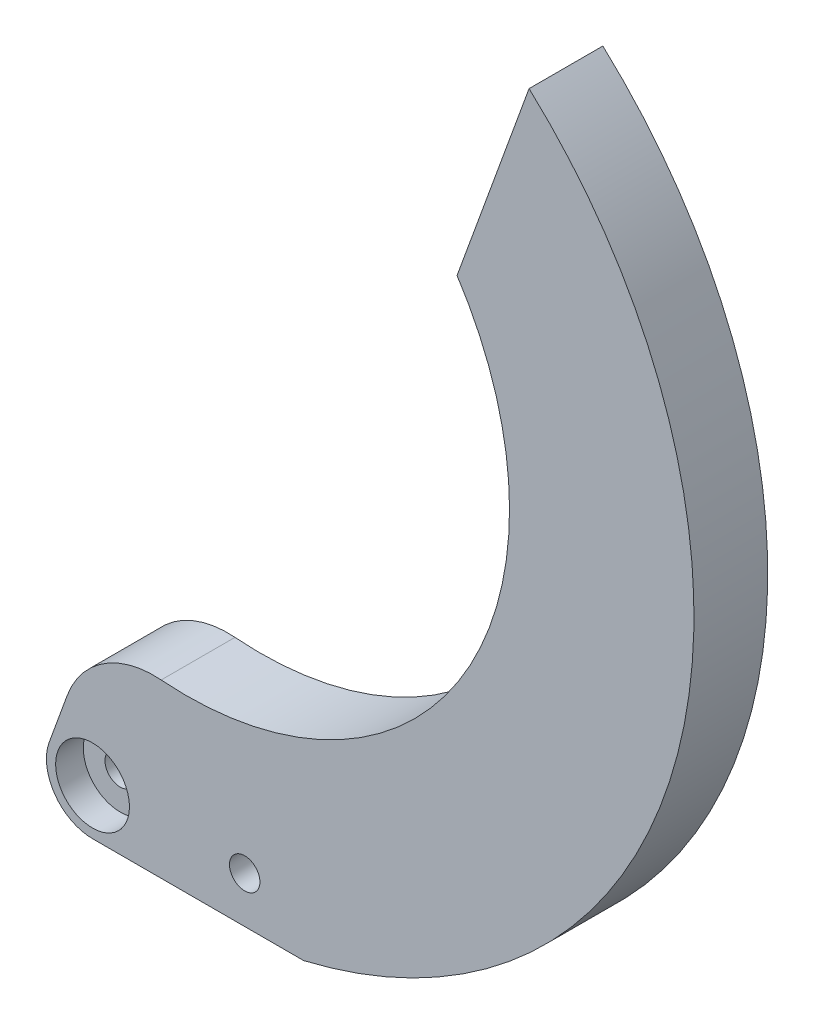
ISO-10303-21;
HEADER;
FILE_DESCRIPTION(('STEP AP214'),'2;1');
FILE_NAME('part.step','',(''),(''),'','','');
FILE_SCHEMA(('AUTOMOTIVE_DESIGN { 1 0 10303 214 1 1 1 1 }'));
ENDSEC;
DATA;
#1=APPLICATION_CONTEXT('core data for automotive mechanical design processes');
#2=APPLICATION_PROTOCOL_DEFINITION('international standard','automotive_design',2000,#1);
#3=PRODUCT_CONTEXT('',#1,'mechanical');
#4=PRODUCT('Part','Part','',(#3));
#5=PRODUCT_RELATED_PRODUCT_CATEGORY('part','',(#4));
#6=PRODUCT_DEFINITION_FORMATION('','',#4);
#7=PRODUCT_DEFINITION_CONTEXT('part definition',#1,'design');
#8=PRODUCT_DEFINITION('design','',#6,#7);
#9=PRODUCT_DEFINITION_SHAPE('','',#8);
#10=(LENGTH_UNIT() NAMED_UNIT(*) SI_UNIT(.MILLI.,.METRE.));
#11=(NAMED_UNIT(*) PLANE_ANGLE_UNIT() SI_UNIT($,.RADIAN.));
#12=(NAMED_UNIT(*) SI_UNIT($,.STERADIAN.) SOLID_ANGLE_UNIT());
#13=UNCERTAINTY_MEASURE_WITH_UNIT(LENGTH_MEASURE(1.E-05),#10,'distance_accuracy_value','');
#14=(GEOMETRIC_REPRESENTATION_CONTEXT(3) GLOBAL_UNCERTAINTY_ASSIGNED_CONTEXT((#13)) GLOBAL_UNIT_ASSIGNED_CONTEXT((#10,
#11,#12)) REPRESENTATION_CONTEXT('',''));
#15=CARTESIAN_POINT('',(0.,0.,0.));
#16=DIRECTION('',(0.,0.,1.));
#17=DIRECTION('',(1.,0.,0.));
#18=AXIS2_PLACEMENT_3D('',#15,#16,#17);
#19=CARTESIAN_POINT('',(0.,0.,8.));
#20=DIRECTION('',(0.,0.,1.));
#21=DIRECTION('',(1.,0.,0.));
#22=AXIS2_PLACEMENT_3D('',#19,#20,#21);
#23=PLANE('',#22);
#24=CARTESIAN_POINT('',(16.5,0.,8.));
#25=DIRECTION('',(0.,0.,1.));
#26=DIRECTION('',(1.,0.,0.));
#27=AXIS2_PLACEMENT_3D('',#24,#25,#26);
#28=CIRCLE('',#27,1.65);
#29=CARTESIAN_POINT('',(18.15,0.,8.));
#30=VERTEX_POINT('',#29);
#31=EDGE_CURVE('E154',#30,#30,#28,.T.);
#32=ORIENTED_EDGE('',*,*,#31,.F.);
#33=EDGE_LOOP('',(#32));
#34=FACE_BOUND('',#33,.T.);
#35=CARTESIAN_POINT('',(10.2151518274149,48.5181205647917,8.));
#36=DIRECTION('',(0.,0.,-1.));
#37=DIRECTION('',(1.,0.,0.));
#38=AXIS2_PLACEMENT_3D('',#35,#36,#37);
#39=CIRCLE('',#38,35.);
#40=CARTESIAN_POINT('',(39.5252608770376,67.6470909369582,8.));
#41=VERTEX_POINT('',#40);
#42=CARTESIAN_POINT('',(7.44442006285707,13.627963708038,8.));
#43=VERTEX_POINT('',#42);
#44=EDGE_CURVE('E147',#41,#43,#39,.T.);
#45=ORIENTED_EDGE('',*,*,#44,.T.);
#46=CARTESIAN_POINT('',(6.65278241584056,3.65934746325131,8.));
#47=DIRECTION('',(0.,0.,1.));
#48=DIRECTION('',(1.,0.,0.));
#49=AXIS2_PLACEMENT_3D('',#46,#47,#48);
#50=CIRCLE('',#49,10.);
#51=CARTESIAN_POINT('',(-2.74414379201854,7.07954889650796,8.));
#52=VERTEX_POINT('',#51);
#53=EDGE_CURVE('E11',#43,#52,#50,.T.);
#54=ORIENTED_EDGE('',*,*,#53,.T.);
#55=DIRECTION('',(-0.342020143325666,-0.939692620785909,0.));
#56=VECTOR('',#55,1.);
#57=CARTESIAN_POINT('',(-4.69846310392955,1.71010071662833,8.));
#58=LINE('',#57,#56);
#59=CARTESIAN_POINT('',(-4.69846310392955,1.71010071662833,8.));
#60=VERTEX_POINT('',#59);
#61=EDGE_CURVE('E110',#52,#60,#58,.T.);
#62=ORIENTED_EDGE('',*,*,#61,.T.);
#63=CARTESIAN_POINT('',(0.,0.,8.));
#64=DIRECTION('',(0.,0.,1.));
#65=DIRECTION('',(1.,0.,0.));
#66=AXIS2_PLACEMENT_3D('',#63,#64,#65);
#67=CIRCLE('',#66,5.);
#68=CARTESIAN_POINT('',(0.,-5.,8.));
#69=VERTEX_POINT('',#68);
#70=EDGE_CURVE('E105',#60,#69,#67,.T.);
#71=ORIENTED_EDGE('',*,*,#70,.T.);
#72=DIRECTION('',(1.,0.,0.));
#73=VECTOR('',#72,1.);
#74=CARTESIAN_POINT('',(0.,-5.,8.));
#75=LINE('',#74,#73);
#76=CARTESIAN_POINT('',(22.8962705167271,-5.,8.));
#77=VERTEX_POINT('',#76);
#78=EDGE_CURVE('E94',#69,#77,#75,.T.);
#79=ORIENTED_EDGE('',*,*,#78,.T.);
#80=CARTESIAN_POINT('',(10.2151518274149,48.5181205647917,8.));
#81=DIRECTION('',(0.,0.,1.));
#82=DIRECTION('',(1.,0.,0.));
#83=AXIS2_PLACEMENT_3D('',#80,#81,#82);
#84=CIRCLE('',#83,55.);
#85=CARTESIAN_POINT('',(47.3346273679292,89.1031490309287,8.));
#86=VERTEX_POINT('',#85);
#87=EDGE_CURVE('E104',#77,#86,#84,.T.);
#88=ORIENTED_EDGE('',*,*,#87,.T.);
#89=DIRECTION('',(-0.342020143325666,-0.939692620785909,0.));
#90=VECTOR('',#89,1.);
#91=CARTESIAN_POINT('',(47.3346273679292,89.1031490309287,8.));
#92=LINE('',#91,#90);
#93=EDGE_CURVE('E149',#86,#41,#92,.T.);
#94=ORIENTED_EDGE('',*,*,#93,.T.);
#95=EDGE_LOOP('',(#45,#54,#62,#71,#79,#88,#94));
#96=FACE_BOUND('',#95,.T.);
#97=CARTESIAN_POINT('',(0.,0.,8.));
#98=DIRECTION('',(0.,0.,-1.));
#99=DIRECTION('',(-1.,0.,0.));
#100=AXIS2_PLACEMENT_3D('',#97,#98,#99);
#101=CIRCLE('',#100,4.);
#102=CARTESIAN_POINT('',(-4.,0.,8.));
#103=VERTEX_POINT('',#102);
#104=EDGE_CURVE('E160',#103,#103,#101,.T.);
#105=ORIENTED_EDGE('',*,*,#104,.T.);
#106=EDGE_LOOP('',(#105));
#107=FACE_BOUND('',#106,.T.);
#108=ADVANCED_FACE('F34',(#34,#96,#107),#23,.T.);
#109=CARTESIAN_POINT('',(0.,0.,0.));
#110=DIRECTION('',(0.,0.,1.));
#111=DIRECTION('',(1.,0.,0.));
#112=AXIS2_PLACEMENT_3D('',#109,#110,#111);
#113=PLANE('',#112);
#114=CARTESIAN_POINT('',(0.,0.,0.));
#115=DIRECTION('',(0.,0.,1.));
#116=DIRECTION('',(1.,0.,0.));
#117=AXIS2_PLACEMENT_3D('',#114,#115,#116);
#118=CIRCLE('',#117,1.65);
#119=CARTESIAN_POINT('',(1.65,0.,0.));
#120=VERTEX_POINT('',#119);
#121=EDGE_CURVE('E145',#120,#120,#118,.T.);
#122=ORIENTED_EDGE('',*,*,#121,.T.);
#123=EDGE_LOOP('',(#122));
#124=FACE_BOUND('',#123,.T.);
#125=DIRECTION('',(-0.342020143325666,-0.939692620785909,0.));
#126=VECTOR('',#125,1.);
#127=CARTESIAN_POINT('',(-4.69846310392955,1.71010071662833,0.));
#128=LINE('',#127,#126);
#129=CARTESIAN_POINT('',(-2.74414379201854,7.07954889650796,0.));
#130=VERTEX_POINT('',#129);
#131=CARTESIAN_POINT('',(-4.69846310392955,1.71010071662833,0.));
#132=VERTEX_POINT('',#131);
#133=EDGE_CURVE('E114',#130,#132,#128,.T.);
#134=ORIENTED_EDGE('',*,*,#133,.F.);
#135=CARTESIAN_POINT('',(6.65278241584056,3.65934746325131,0.));
#136=DIRECTION('',(0.,0.,1.));
#137=DIRECTION('',(1.,0.,0.));
#138=AXIS2_PLACEMENT_3D('',#135,#136,#137);
#139=CIRCLE('',#138,10.);
#140=CARTESIAN_POINT('',(7.44442006285707,13.627963708038,0.));
#141=VERTEX_POINT('',#140);
#142=EDGE_CURVE('E57',#130,#141,#139,.F.);
#143=ORIENTED_EDGE('',*,*,#142,.T.);
#144=CARTESIAN_POINT('',(10.2151518274149,48.5181205647917,0.));
#145=DIRECTION('',(0.,0.,-1.));
#146=DIRECTION('',(1.,0.,0.));
#147=AXIS2_PLACEMENT_3D('',#144,#145,#146);
#148=CIRCLE('',#147,35.);
#149=CARTESIAN_POINT('',(39.5252608770376,67.6470909369582,0.));
#150=VERTEX_POINT('',#149);
#151=EDGE_CURVE('E136',#150,#141,#148,.T.);
#152=ORIENTED_EDGE('',*,*,#151,.F.);
#153=DIRECTION('',(-0.342020143325666,-0.939692620785909,0.));
#154=VECTOR('',#153,1.);
#155=CARTESIAN_POINT('',(47.3346273679292,89.1031490309287,0.));
#156=LINE('',#155,#154);
#157=CARTESIAN_POINT('',(47.3346273679292,89.1031490309287,0.));
#158=VERTEX_POINT('',#157);
#159=EDGE_CURVE('E138',#158,#150,#156,.T.);
#160=ORIENTED_EDGE('',*,*,#159,.F.);
#161=CARTESIAN_POINT('',(10.2151518274149,48.5181205647917,0.));
#162=DIRECTION('',(0.,0.,1.));
#163=DIRECTION('',(1.,0.,0.));
#164=AXIS2_PLACEMENT_3D('',#161,#162,#163);
#165=CIRCLE('',#164,55.);
#166=CARTESIAN_POINT('',(22.8962705167271,-5.,0.));
#167=VERTEX_POINT('',#166);
#168=EDGE_CURVE('E140',#167,#158,#165,.T.);
#169=ORIENTED_EDGE('',*,*,#168,.F.);
#170=DIRECTION('',(1.,0.,0.));
#171=VECTOR('',#170,1.);
#172=CARTESIAN_POINT('',(0.,-5.,0.));
#173=LINE('',#172,#171);
#174=CARTESIAN_POINT('',(0.,-5.,0.));
#175=VERTEX_POINT('',#174);
#176=EDGE_CURVE('E142',#175,#167,#173,.T.);
#177=ORIENTED_EDGE('',*,*,#176,.F.);
#178=CARTESIAN_POINT('',(0.,0.,0.));
#179=DIRECTION('',(0.,0.,1.));
#180=DIRECTION('',(1.,0.,0.));
#181=AXIS2_PLACEMENT_3D('',#178,#179,#180);
#182=CIRCLE('',#181,5.);
#183=EDGE_CURVE('E118',#132,#175,#182,.T.);
#184=ORIENTED_EDGE('',*,*,#183,.F.);
#185=EDGE_LOOP('',(#134,#143,#152,#160,#169,#177,#184));
#186=FACE_BOUND('',#185,.T.);
#187=CARTESIAN_POINT('',(16.5,0.,0.));
#188=DIRECTION('',(0.,0.,1.));
#189=DIRECTION('',(1.,0.,0.));
#190=AXIS2_PLACEMENT_3D('',#187,#188,#189);
#191=CIRCLE('',#190,1.65);
#192=CARTESIAN_POINT('',(18.15,0.,0.));
#193=VERTEX_POINT('',#192);
#194=EDGE_CURVE('E155',#193,#193,#191,.T.);
#195=ORIENTED_EDGE('',*,*,#194,.T.);
#196=EDGE_LOOP('',(#195));
#197=FACE_BOUND('',#196,.T.);
#198=ADVANCED_FACE('F181',(#124,#186,#197),#113,.F.);
#199=CARTESIAN_POINT('',(0.,0.,8.));
#200=DIRECTION('',(0.,0.,-1.));
#201=DIRECTION('',(-1.,0.,0.));
#202=AXIS2_PLACEMENT_3D('',#199,#200,#201);
#203=CYLINDRICAL_SURFACE('',#202,5.);
#204=ORIENTED_EDGE('',*,*,#183,.T.);
#205=DIRECTION('',(0.,0.,-1.));
#206=VECTOR('',#205,1.);
#207=CARTESIAN_POINT('',(0.,-5.,8.));
#208=LINE('',#207,#206);
#209=EDGE_CURVE('E98',#69,#175,#208,.T.);
#210=ORIENTED_EDGE('',*,*,#209,.F.);
#211=ORIENTED_EDGE('',*,*,#70,.F.);
#212=DIRECTION('',(0.,0.,-1.));
#213=VECTOR('',#212,1.);
#214=CARTESIAN_POINT('',(-4.69846310392955,1.71010071662833,8.));
#215=LINE('',#214,#213);
#216=EDGE_CURVE('E133',#60,#132,#215,.T.);
#217=ORIENTED_EDGE('',*,*,#216,.T.);
#218=EDGE_LOOP('',(#204,#210,#211,#217));
#219=FACE_BOUND('',#218,.T.);
#220=ADVANCED_FACE('F116',(#219),#203,.T.);
#221=CARTESIAN_POINT('',(0.,-5.,8.));
#222=DIRECTION('',(0.,1.,0.));
#223=DIRECTION('',(-1.,0.,0.));
#224=AXIS2_PLACEMENT_3D('',#221,#222,#223);
#225=PLANE('',#224);
#226=ORIENTED_EDGE('',*,*,#176,.T.);
#227=DIRECTION('',(0.,0.,-1.));
#228=VECTOR('',#227,1.);
#229=CARTESIAN_POINT('',(22.8962705167271,-5.,8.));
#230=LINE('',#229,#228);
#231=EDGE_CURVE('E101',#77,#167,#230,.T.);
#232=ORIENTED_EDGE('',*,*,#231,.F.);
#233=ORIENTED_EDGE('',*,*,#78,.F.);
#234=ORIENTED_EDGE('',*,*,#209,.T.);
#235=EDGE_LOOP('',(#226,#232,#233,#234));
#236=FACE_BOUND('',#235,.T.);
#237=ADVANCED_FACE('F96',(#236),#225,.F.);
#238=CARTESIAN_POINT('',(10.2151518274149,48.5181205647917,8.));
#239=DIRECTION('',(0.,0.,-1.));
#240=DIRECTION('',(-1.,0.,0.));
#241=AXIS2_PLACEMENT_3D('',#238,#239,#240);
#242=CYLINDRICAL_SURFACE('',#241,55.);
#243=ORIENTED_EDGE('',*,*,#168,.T.);
#244=DIRECTION('',(0.,0.,-1.));
#245=VECTOR('',#244,1.);
#246=CARTESIAN_POINT('',(47.3346273679292,89.1031490309287,8.));
#247=LINE('',#246,#245);
#248=EDGE_CURVE('E123',#86,#158,#247,.T.);
#249=ORIENTED_EDGE('',*,*,#248,.F.);
#250=ORIENTED_EDGE('',*,*,#87,.F.);
#251=ORIENTED_EDGE('',*,*,#231,.T.);
#252=EDGE_LOOP('',(#243,#249,#250,#251));
#253=FACE_BOUND('',#252,.T.);
#254=ADVANCED_FACE('F212',(#253),#242,.T.);
#255=CARTESIAN_POINT('',(47.3346273679292,89.1031490309287,8.));
#256=DIRECTION('',(0.939692620785909,-0.342020143325666,0.));
#257=DIRECTION('',(0.342020143325666,0.939692620785909,0.));
#258=AXIS2_PLACEMENT_3D('',#255,#256,#257);
#259=PLANE('',#258);
#260=ORIENTED_EDGE('',*,*,#159,.T.);
#261=DIRECTION('',(0.,0.,-1.));
#262=VECTOR('',#261,1.);
#263=CARTESIAN_POINT('',(39.5252608770376,67.6470909369582,8.));
#264=LINE('',#263,#262);
#265=EDGE_CURVE('E130',#41,#150,#264,.T.);
#266=ORIENTED_EDGE('',*,*,#265,.F.);
#267=ORIENTED_EDGE('',*,*,#93,.F.);
#268=ORIENTED_EDGE('',*,*,#248,.T.);
#269=EDGE_LOOP('',(#260,#266,#267,#268));
#270=FACE_BOUND('',#269,.T.);
#271=ADVANCED_FACE('F209',(#270),#259,.F.);
#272=CARTESIAN_POINT('',(10.2151518274149,48.5181205647917,8.));
#273=DIRECTION('',(0.,0.,-1.));
#274=DIRECTION('',(-1.,0.,0.));
#275=AXIS2_PLACEMENT_3D('',#272,#273,#274);
#276=CYLINDRICAL_SURFACE('',#275,35.);
#277=ORIENTED_EDGE('',*,*,#151,.T.);
#278=DIRECTION('',(0.,0.,-1.));
#279=VECTOR('',#278,1.);
#280=CARTESIAN_POINT('',(7.44442006285707,13.627963708038,8.));
#281=LINE('',#280,#279);
#282=EDGE_CURVE('E43',#141,#43,#281,.F.);
#283=ORIENTED_EDGE('',*,*,#282,.T.);
#284=ORIENTED_EDGE('',*,*,#44,.F.);
#285=ORIENTED_EDGE('',*,*,#265,.T.);
#286=EDGE_LOOP('',(#277,#283,#284,#285));
#287=FACE_BOUND('',#286,.T.);
#288=ADVANCED_FACE('F205',(#287),#276,.F.);
#289=CARTESIAN_POINT('',(-4.69846310392955,1.71010071662833,8.));
#290=DIRECTION('',(0.93969262078591,-0.342020143325666,0.));
#291=DIRECTION('',(0.342020143325666,0.93969262078591,0.));
#292=AXIS2_PLACEMENT_3D('',#289,#290,#291);
#293=PLANE('',#292);
#294=ORIENTED_EDGE('',*,*,#61,.F.);
#295=DIRECTION('',(0.,0.,-1.));
#296=VECTOR('',#295,1.);
#297=CARTESIAN_POINT('',(-2.74414379201854,7.07954889650796,8.));
#298=LINE('',#297,#296);
#299=EDGE_CURVE('E119',#52,#130,#298,.T.);
#300=ORIENTED_EDGE('',*,*,#299,.T.);
#301=ORIENTED_EDGE('',*,*,#133,.T.);
#302=ORIENTED_EDGE('',*,*,#216,.F.);
#303=EDGE_LOOP('',(#294,#300,#301,#302));
#304=FACE_BOUND('',#303,.T.);
#305=ADVANCED_FACE('F177',(#304),#293,.F.);
#306=CARTESIAN_POINT('',(0.,0.,8.));
#307=DIRECTION('',(0.,0.,-1.));
#308=DIRECTION('',(-1.,0.,0.));
#309=AXIS2_PLACEMENT_3D('',#306,#307,#308);
#310=CYLINDRICAL_SURFACE('',#309,1.65);
#311=CARTESIAN_POINT('',(0.,0.,5.));
#312=DIRECTION('',(0.,0.,-1.));
#313=DIRECTION('',(-1.,0.,0.));
#314=AXIS2_PLACEMENT_3D('',#311,#312,#313);
#315=CIRCLE('',#314,1.65);
#316=CARTESIAN_POINT('',(-1.65,0.,5.));
#317=VERTEX_POINT('',#316);
#318=EDGE_CURVE('E38',#317,#317,#315,.T.);
#319=ORIENTED_EDGE('',*,*,#318,.F.);
#320=EDGE_LOOP('',(#319));
#321=FACE_BOUND('',#320,.T.);
#322=ORIENTED_EDGE('',*,*,#121,.F.);
#323=EDGE_LOOP('',(#322));
#324=FACE_BOUND('',#323,.T.);
#325=ADVANCED_FACE('F173',(#321,#324),#310,.F.);
#326=CARTESIAN_POINT('',(16.5,0.,8.));
#327=DIRECTION('',(0.,0.,-1.));
#328=DIRECTION('',(-1.,0.,0.));
#329=AXIS2_PLACEMENT_3D('',#326,#327,#328);
#330=CYLINDRICAL_SURFACE('',#329,1.65);
#331=ORIENTED_EDGE('',*,*,#31,.T.);
#332=EDGE_LOOP('',(#331));
#333=FACE_BOUND('',#332,.T.);
#334=ORIENTED_EDGE('',*,*,#194,.F.);
#335=EDGE_LOOP('',(#334));
#336=FACE_BOUND('',#335,.T.);
#337=ADVANCED_FACE('F176',(#333,#336),#330,.F.);
#338=CARTESIAN_POINT('',(6.65278241584056,3.65934746325131,8.));
#339=DIRECTION('',(0.,0.,-1.));
#340=DIRECTION('',(-1.,0.,0.));
#341=AXIS2_PLACEMENT_3D('',#338,#339,#340);
#342=CYLINDRICAL_SURFACE('',#341,10.);
#343=ORIENTED_EDGE('',*,*,#53,.F.);
#344=ORIENTED_EDGE('',*,*,#282,.F.);
#345=ORIENTED_EDGE('',*,*,#142,.F.);
#346=ORIENTED_EDGE('',*,*,#299,.F.);
#347=EDGE_LOOP('',(#343,#344,#345,#346));
#348=FACE_BOUND('',#347,.T.);
#349=ADVANCED_FACE('F36',(#348),#342,.T.);
#350=CARTESIAN_POINT('',(0.,0.,5.));
#351=DIRECTION('',(0.,0.,1.));
#352=DIRECTION('',(1.,0.,0.));
#353=AXIS2_PLACEMENT_3D('',#350,#351,#352);
#354=CYLINDRICAL_SURFACE('',#353,4.);
#355=CARTESIAN_POINT('',(0.,0.,5.));
#356=DIRECTION('',(0.,0.,-1.));
#357=DIRECTION('',(-1.,0.,0.));
#358=AXIS2_PLACEMENT_3D('',#355,#356,#357);
#359=CIRCLE('',#358,4.);
#360=CARTESIAN_POINT('',(-4.,0.,5.));
#361=VERTEX_POINT('',#360);
#362=EDGE_CURVE('E163',#361,#361,#359,.T.);
#363=ORIENTED_EDGE('',*,*,#362,.T.);
#364=EDGE_LOOP('',(#363));
#365=FACE_BOUND('',#364,.T.);
#366=ORIENTED_EDGE('',*,*,#104,.F.);
#367=EDGE_LOOP('',(#366));
#368=FACE_BOUND('',#367,.T.);
#369=ADVANCED_FACE('F193',(#365,#368),#354,.F.);
#370=CARTESIAN_POINT('',(0.,0.,5.));
#371=DIRECTION('',(0.,0.,-1.));
#372=DIRECTION('',(-1.,0.,0.));
#373=AXIS2_PLACEMENT_3D('',#370,#371,#372);
#374=PLANE('',#373);
#375=ORIENTED_EDGE('',*,*,#318,.T.);
#376=EDGE_LOOP('',(#375));
#377=FACE_BOUND('',#376,.T.);
#378=ORIENTED_EDGE('',*,*,#362,.F.);
#379=EDGE_LOOP('',(#378));
#380=FACE_BOUND('',#379,.T.);
#381=ADVANCED_FACE('F170',(#377,#380),#374,.F.);
#382=CLOSED_SHELL('',(#108,#198,#220,#237,#254,#271,#288,#305,#325,#337,#349,#369,#381));
#383=MANIFOLD_SOLID_BREP('B2',#382);
#384=ADVANCED_BREP_SHAPE_REPRESENTATION('',(#18,#383),#14);
#385=SHAPE_DEFINITION_REPRESENTATION(#9,#384);
ENDSEC;
END-ISO-10303-21;
